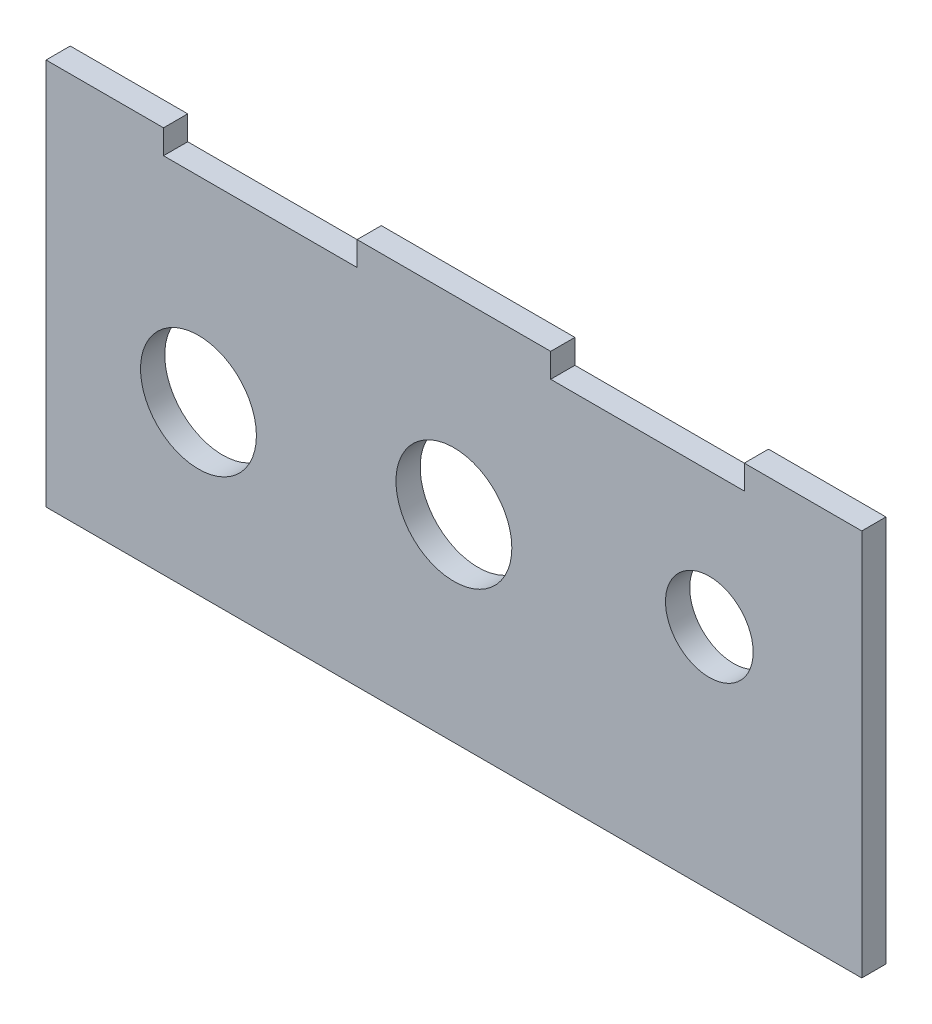
ISO-10303-21;
HEADER;
FILE_DESCRIPTION(('STEP AP214'),'2;1');
FILE_NAME('part.step','',(''),(''),'','','');
FILE_SCHEMA(('AUTOMOTIVE_DESIGN { 1 0 10303 214 1 1 1 1 }'));
ENDSEC;
DATA;
#1=APPLICATION_CONTEXT('core data for automotive mechanical design processes');
#2=APPLICATION_PROTOCOL_DEFINITION('international standard','automotive_design',2000,#1);
#3=PRODUCT_CONTEXT('',#1,'mechanical');
#4=PRODUCT('Part','Part','',(#3));
#5=PRODUCT_RELATED_PRODUCT_CATEGORY('part','',(#4));
#6=PRODUCT_DEFINITION_FORMATION('','',#4);
#7=PRODUCT_DEFINITION_CONTEXT('part definition',#1,'design');
#8=PRODUCT_DEFINITION('design','',#6,#7);
#9=PRODUCT_DEFINITION_SHAPE('','',#8);
#10=(LENGTH_UNIT() NAMED_UNIT(*) SI_UNIT(.MILLI.,.METRE.));
#11=(NAMED_UNIT(*) PLANE_ANGLE_UNIT() SI_UNIT($,.RADIAN.));
#12=(NAMED_UNIT(*) SI_UNIT($,.STERADIAN.) SOLID_ANGLE_UNIT());
#13=UNCERTAINTY_MEASURE_WITH_UNIT(LENGTH_MEASURE(1.E-05),#10,'distance_accuracy_value','');
#14=(GEOMETRIC_REPRESENTATION_CONTEXT(3) GLOBAL_UNCERTAINTY_ASSIGNED_CONTEXT((#13)) GLOBAL_UNIT_ASSIGNED_CONTEXT((#10,
#11,#12)) REPRESENTATION_CONTEXT('',''));
#15=CARTESIAN_POINT('',(0.,0.,0.));
#16=DIRECTION('',(0.,0.,1.));
#17=DIRECTION('',(1.,0.,0.));
#18=AXIS2_PLACEMENT_3D('',#15,#16,#17);
#19=CARTESIAN_POINT('',(0.,47.625,3.175));
#20=DIRECTION('',(0.,1.,0.));
#21=DIRECTION('',(0.,0.,1.));
#22=AXIS2_PLACEMENT_3D('',#19,#20,#21);
#23=PLANE('',#22);
#24=DIRECTION('',(1.,0.,0.));
#25=VECTOR('',#24,1.);
#26=CARTESIAN_POINT('',(0.,47.625,0.));
#27=LINE('',#26,#25);
#28=CARTESIAN_POINT('',(15.4128700790452,47.625,0.));
#29=VERTEX_POINT('',#28);
#30=CARTESIAN_POINT('',(40.8128700790452,47.625,0.));
#31=VERTEX_POINT('',#30);
#32=EDGE_CURVE('E167',#29,#31,#27,.T.);
#33=ORIENTED_EDGE('',*,*,#32,.F.);
#34=DIRECTION('',(0.,0.,-1.));
#35=VECTOR('',#34,1.);
#36=CARTESIAN_POINT('',(15.4128700790452,47.625,3.175));
#37=LINE('',#36,#35);
#38=CARTESIAN_POINT('',(15.4128700790452,47.625,3.175));
#39=VERTEX_POINT('',#38);
#40=EDGE_CURVE('E11',#39,#29,#37,.T.);
#41=ORIENTED_EDGE('',*,*,#40,.F.);
#42=DIRECTION('',(1.,0.,0.));
#43=VECTOR('',#42,1.);
#44=CARTESIAN_POINT('',(0.,47.625,3.175));
#45=LINE('',#44,#43);
#46=CARTESIAN_POINT('',(40.8128700790452,47.625,3.175));
#47=VERTEX_POINT('',#46);
#48=EDGE_CURVE('E203',#39,#47,#45,.T.);
#49=ORIENTED_EDGE('',*,*,#48,.T.);
#50=DIRECTION('',(0.,0.,-1.));
#51=VECTOR('',#50,1.);
#52=CARTESIAN_POINT('',(40.8128700790452,47.625,3.175));
#53=LINE('',#52,#51);
#54=EDGE_CURVE('E103',#47,#31,#53,.T.);
#55=ORIENTED_EDGE('',*,*,#54,.T.);
#56=EDGE_LOOP('',(#33,#41,#49,#55));
#57=FACE_BOUND('',#56,.T.);
#58=ADVANCED_FACE('F40',(#57),#23,.T.);
#59=CARTESIAN_POINT('',(15.4128700790452,0.,3.175));
#60=DIRECTION('',(1.,0.,0.));
#61=DIRECTION('',(0.,0.,-1.));
#62=AXIS2_PLACEMENT_3D('',#59,#60,#61);
#63=PLANE('',#62);
#64=DIRECTION('',(0.,-1.,0.));
#65=VECTOR('',#64,1.);
#66=CARTESIAN_POINT('',(15.4128700790452,0.,0.));
#67=LINE('',#66,#65);
#68=CARTESIAN_POINT('',(15.4128700790452,50.8,0.));
#69=VERTEX_POINT('',#68);
#70=EDGE_CURVE('E170',#69,#29,#67,.T.);
#71=ORIENTED_EDGE('',*,*,#70,.F.);
#72=DIRECTION('',(0.,0.,-1.));
#73=VECTOR('',#72,1.);
#74=CARTESIAN_POINT('',(15.4128700790452,50.8,3.175));
#75=LINE('',#74,#73);
#76=CARTESIAN_POINT('',(15.4128700790452,50.8,3.175));
#77=VERTEX_POINT('',#76);
#78=EDGE_CURVE('E49',#77,#69,#75,.T.);
#79=ORIENTED_EDGE('',*,*,#78,.F.);
#80=DIRECTION('',(0.,-1.,0.));
#81=VECTOR('',#80,1.);
#82=CARTESIAN_POINT('',(15.4128700790452,0.,3.175));
#83=LINE('',#82,#81);
#84=EDGE_CURVE('E241',#77,#39,#83,.T.);
#85=ORIENTED_EDGE('',*,*,#84,.T.);
#86=ORIENTED_EDGE('',*,*,#40,.T.);
#87=EDGE_LOOP('',(#71,#79,#85,#86));
#88=FACE_BOUND('',#87,.T.);
#89=ADVANCED_FACE('F42',(#88),#63,.T.);
#90=CARTESIAN_POINT('',(0.,50.8,3.175));
#91=DIRECTION('',(0.,1.,0.));
#92=DIRECTION('',(0.,0.,1.));
#93=AXIS2_PLACEMENT_3D('',#90,#91,#92);
#94=PLANE('',#93);
#95=DIRECTION('',(1.,0.,0.));
#96=VECTOR('',#95,1.);
#97=CARTESIAN_POINT('',(0.,50.8,0.));
#98=LINE('',#97,#96);
#99=CARTESIAN_POINT('',(0.,50.8,0.));
#100=VERTEX_POINT('',#99);
#101=EDGE_CURVE('E174',#100,#69,#98,.T.);
#102=ORIENTED_EDGE('',*,*,#101,.F.);
#103=DIRECTION('',(0.,0.,-1.));
#104=VECTOR('',#103,1.);
#105=CARTESIAN_POINT('',(0.,50.8,3.175));
#106=LINE('',#105,#104);
#107=CARTESIAN_POINT('',(0.,50.8,3.175));
#108=VERTEX_POINT('',#107);
#109=EDGE_CURVE('E218',#108,#100,#106,.T.);
#110=ORIENTED_EDGE('',*,*,#109,.F.);
#111=DIRECTION('',(1.,0.,0.));
#112=VECTOR('',#111,1.);
#113=CARTESIAN_POINT('',(0.,50.8,3.175));
#114=LINE('',#113,#112);
#115=EDGE_CURVE('E225',#108,#77,#114,.T.);
#116=ORIENTED_EDGE('',*,*,#115,.T.);
#117=ORIENTED_EDGE('',*,*,#78,.T.);
#118=EDGE_LOOP('',(#102,#110,#116,#117));
#119=FACE_BOUND('',#118,.T.);
#120=ADVANCED_FACE('F223',(#119),#94,.T.);
#121=CARTESIAN_POINT('',(0.,0.,3.175));
#122=DIRECTION('',(-1.,0.,0.));
#123=DIRECTION('',(0.,0.,1.));
#124=AXIS2_PLACEMENT_3D('',#121,#122,#123);
#125=PLANE('',#124);
#126=DIRECTION('',(0.,1.,0.));
#127=VECTOR('',#126,1.);
#128=CARTESIAN_POINT('',(0.,0.,0.));
#129=LINE('',#128,#127);
#130=CARTESIAN_POINT('',(0.,0.,0.));
#131=VERTEX_POINT('',#130);
#132=EDGE_CURVE('E177',#131,#100,#129,.T.);
#133=ORIENTED_EDGE('',*,*,#132,.F.);
#134=DIRECTION('',(0.,0.,-1.));
#135=VECTOR('',#134,1.);
#136=CARTESIAN_POINT('',(0.,0.,3.175));
#137=LINE('',#136,#135);
#138=CARTESIAN_POINT('',(0.,0.,3.175));
#139=VERTEX_POINT('',#138);
#140=EDGE_CURVE('E216',#139,#131,#137,.T.);
#141=ORIENTED_EDGE('',*,*,#140,.F.);
#142=DIRECTION('',(0.,1.,0.));
#143=VECTOR('',#142,1.);
#144=CARTESIAN_POINT('',(0.,0.,3.175));
#145=LINE('',#144,#143);
#146=EDGE_CURVE('E240',#139,#108,#145,.T.);
#147=ORIENTED_EDGE('',*,*,#146,.T.);
#148=ORIENTED_EDGE('',*,*,#109,.T.);
#149=EDGE_LOOP('',(#133,#141,#147,#148));
#150=FACE_BOUND('',#149,.T.);
#151=ADVANCED_FACE('F236',(#150),#125,.T.);
#152=CARTESIAN_POINT('',(0.,0.,3.175));
#153=DIRECTION('',(0.,1.,0.));
#154=DIRECTION('',(0.,0.,1.));
#155=AXIS2_PLACEMENT_3D('',#152,#153,#154);
#156=PLANE('',#155);
#157=DIRECTION('',(1.,0.,0.));
#158=VECTOR('',#157,1.);
#159=CARTESIAN_POINT('',(0.,0.,0.));
#160=LINE('',#159,#158);
#161=CARTESIAN_POINT('',(107.02574015809,0.,0.));
#162=VERTEX_POINT('',#161);
#163=EDGE_CURVE('E181',#131,#162,#160,.T.);
#164=ORIENTED_EDGE('',*,*,#163,.T.);
#165=DIRECTION('',(0.,0.,-1.));
#166=VECTOR('',#165,1.);
#167=CARTESIAN_POINT('',(107.02574015809,0.,3.175));
#168=LINE('',#167,#166);
#169=CARTESIAN_POINT('',(107.02574015809,0.,3.175));
#170=VERTEX_POINT('',#169);
#171=EDGE_CURVE('E213',#170,#162,#168,.T.);
#172=ORIENTED_EDGE('',*,*,#171,.F.);
#173=DIRECTION('',(1.,0.,0.));
#174=VECTOR('',#173,1.);
#175=CARTESIAN_POINT('',(0.,0.,3.175));
#176=LINE('',#175,#174);
#177=EDGE_CURVE('E244',#139,#170,#176,.T.);
#178=ORIENTED_EDGE('',*,*,#177,.F.);
#179=ORIENTED_EDGE('',*,*,#140,.T.);
#180=EDGE_LOOP('',(#164,#172,#178,#179));
#181=FACE_BOUND('',#180,.T.);
#182=ADVANCED_FACE('F258',(#181),#156,.F.);
#183=CARTESIAN_POINT('',(107.02574015809,0.,3.175));
#184=DIRECTION('',(-1.,0.,0.));
#185=DIRECTION('',(0.,0.,1.));
#186=AXIS2_PLACEMENT_3D('',#183,#184,#185);
#187=PLANE('',#186);
#188=DIRECTION('',(0.,1.,0.));
#189=VECTOR('',#188,1.);
#190=CARTESIAN_POINT('',(107.02574015809,0.,0.));
#191=LINE('',#190,#189);
#192=CARTESIAN_POINT('',(107.02574015809,50.8,0.));
#193=VERTEX_POINT('',#192);
#194=EDGE_CURVE('E183',#162,#193,#191,.T.);
#195=ORIENTED_EDGE('',*,*,#194,.T.);
#196=DIRECTION('',(0.,0.,-1.));
#197=VECTOR('',#196,1.);
#198=CARTESIAN_POINT('',(107.02574015809,50.8,3.175));
#199=LINE('',#198,#197);
#200=CARTESIAN_POINT('',(107.02574015809,50.8,3.175));
#201=VERTEX_POINT('',#200);
#202=EDGE_CURVE('E211',#201,#193,#199,.T.);
#203=ORIENTED_EDGE('',*,*,#202,.F.);
#204=DIRECTION('',(0.,1.,0.));
#205=VECTOR('',#204,1.);
#206=CARTESIAN_POINT('',(107.02574015809,0.,3.175));
#207=LINE('',#206,#205);
#208=EDGE_CURVE('E249',#170,#201,#207,.T.);
#209=ORIENTED_EDGE('',*,*,#208,.F.);
#210=ORIENTED_EDGE('',*,*,#171,.T.);
#211=EDGE_LOOP('',(#195,#203,#209,#210));
#212=FACE_BOUND('',#211,.T.);
#213=ADVANCED_FACE('F260',(#212),#187,.F.);
#214=CARTESIAN_POINT('',(91.6128700790452,50.8,0.));
#215=VERTEX_POINT('',#214);
#216=EDGE_CURVE('E178',#215,#193,#98,.T.);
#217=ORIENTED_EDGE('',*,*,#216,.F.);
#218=DIRECTION('',(0.,0.,-1.));
#219=VECTOR('',#218,1.);
#220=CARTESIAN_POINT('',(91.6128700790452,50.8,3.175));
#221=LINE('',#220,#219);
#222=CARTESIAN_POINT('',(91.6128700790452,50.8,3.175));
#223=VERTEX_POINT('',#222);
#224=EDGE_CURVE('E209',#223,#215,#221,.T.);
#225=ORIENTED_EDGE('',*,*,#224,.F.);
#226=EDGE_CURVE('E243',#223,#201,#114,.T.);
#227=ORIENTED_EDGE('',*,*,#226,.T.);
#228=ORIENTED_EDGE('',*,*,#202,.T.);
#229=EDGE_LOOP('',(#217,#225,#227,#228));
#230=FACE_BOUND('',#229,.T.);
#231=ADVANCED_FACE('F263',(#230),#94,.T.);
#232=CARTESIAN_POINT('',(91.6128700790452,0.,3.175));
#233=DIRECTION('',(1.,0.,0.));
#234=DIRECTION('',(0.,0.,-1.));
#235=AXIS2_PLACEMENT_3D('',#232,#233,#234);
#236=PLANE('',#235);
#237=DIRECTION('',(0.,-1.,0.));
#238=VECTOR('',#237,1.);
#239=CARTESIAN_POINT('',(91.6128700790452,0.,0.));
#240=LINE('',#239,#238);
#241=CARTESIAN_POINT('',(91.6128700790452,47.625,0.));
#242=VERTEX_POINT('',#241);
#243=EDGE_CURVE('E186',#215,#242,#240,.T.);
#244=ORIENTED_EDGE('',*,*,#243,.T.);
#245=DIRECTION('',(0.,0.,-1.));
#246=VECTOR('',#245,1.);
#247=CARTESIAN_POINT('',(91.6128700790452,47.625,3.175));
#248=LINE('',#247,#246);
#249=CARTESIAN_POINT('',(91.6128700790452,47.625,3.175));
#250=VERTEX_POINT('',#249);
#251=EDGE_CURVE('E207',#250,#242,#248,.T.);
#252=ORIENTED_EDGE('',*,*,#251,.F.);
#253=DIRECTION('',(0.,-1.,0.));
#254=VECTOR('',#253,1.);
#255=CARTESIAN_POINT('',(91.6128700790452,0.,3.175));
#256=LINE('',#255,#254);
#257=EDGE_CURVE('E248',#223,#250,#256,.T.);
#258=ORIENTED_EDGE('',*,*,#257,.F.);
#259=ORIENTED_EDGE('',*,*,#224,.T.);
#260=EDGE_LOOP('',(#244,#252,#258,#259));
#261=FACE_BOUND('',#260,.T.);
#262=ADVANCED_FACE('F270',(#261),#236,.F.);
#263=CARTESIAN_POINT('',(66.2128700790452,47.625,0.));
#264=VERTEX_POINT('',#263);
#265=EDGE_CURVE('E171',#264,#242,#27,.T.);
#266=ORIENTED_EDGE('',*,*,#265,.F.);
#267=DIRECTION('',(0.,0.,-1.));
#268=VECTOR('',#267,1.);
#269=CARTESIAN_POINT('',(66.2128700790452,47.625,3.175));
#270=LINE('',#269,#268);
#271=CARTESIAN_POINT('',(66.2128700790452,47.625,3.175));
#272=VERTEX_POINT('',#271);
#273=EDGE_CURVE('E144',#272,#264,#270,.T.);
#274=ORIENTED_EDGE('',*,*,#273,.F.);
#275=EDGE_CURVE('E151',#272,#250,#45,.T.);
#276=ORIENTED_EDGE('',*,*,#275,.T.);
#277=ORIENTED_EDGE('',*,*,#251,.T.);
#278=EDGE_LOOP('',(#266,#274,#276,#277));
#279=FACE_BOUND('',#278,.T.);
#280=ADVANCED_FACE('F272',(#279),#23,.T.);
#281=CARTESIAN_POINT('',(66.2128700790452,0.,3.175));
#282=DIRECTION('',(1.,0.,0.));
#283=DIRECTION('',(0.,0.,-1.));
#284=AXIS2_PLACEMENT_3D('',#281,#282,#283);
#285=PLANE('',#284);
#286=DIRECTION('',(0.,-1.,0.));
#287=VECTOR('',#286,1.);
#288=CARTESIAN_POINT('',(66.2128700790452,0.,0.));
#289=LINE('',#288,#287);
#290=CARTESIAN_POINT('',(66.2128700790452,50.8,0.));
#291=VERTEX_POINT('',#290);
#292=EDGE_CURVE('E139',#291,#264,#289,.T.);
#293=ORIENTED_EDGE('',*,*,#292,.F.);
#294=DIRECTION('',(0.,0.,-1.));
#295=VECTOR('',#294,1.);
#296=CARTESIAN_POINT('',(66.2128700790452,50.8,3.175));
#297=LINE('',#296,#295);
#298=CARTESIAN_POINT('',(66.2128700790452,50.8,3.175));
#299=VERTEX_POINT('',#298);
#300=EDGE_CURVE('E134',#299,#291,#297,.T.);
#301=ORIENTED_EDGE('',*,*,#300,.F.);
#302=DIRECTION('',(0.,-1.,0.));
#303=VECTOR('',#302,1.);
#304=CARTESIAN_POINT('',(66.2128700790452,0.,3.175));
#305=LINE('',#304,#303);
#306=EDGE_CURVE('E137',#299,#272,#305,.T.);
#307=ORIENTED_EDGE('',*,*,#306,.T.);
#308=ORIENTED_EDGE('',*,*,#273,.T.);
#309=EDGE_LOOP('',(#293,#301,#307,#308));
#310=FACE_BOUND('',#309,.T.);
#311=ADVANCED_FACE('F136',(#310),#285,.T.);
#312=CARTESIAN_POINT('',(0.,50.8,3.175));
#313=DIRECTION('',(0.,1.,0.));
#314=DIRECTION('',(0.,0.,1.));
#315=AXIS2_PLACEMENT_3D('',#312,#313,#314);
#316=PLANE('',#315);
#317=DIRECTION('',(1.,0.,0.));
#318=VECTOR('',#317,1.);
#319=CARTESIAN_POINT('',(0.,50.8,0.));
#320=LINE('',#319,#318);
#321=CARTESIAN_POINT('',(40.8128700790452,50.8,0.));
#322=VERTEX_POINT('',#321);
#323=EDGE_CURVE('E190',#322,#291,#320,.T.);
#324=ORIENTED_EDGE('',*,*,#323,.F.);
#325=DIRECTION('',(0.,0.,-1.));
#326=VECTOR('',#325,1.);
#327=CARTESIAN_POINT('',(40.8128700790452,50.8,3.175));
#328=LINE('',#327,#326);
#329=CARTESIAN_POINT('',(40.8128700790452,50.8,3.175));
#330=VERTEX_POINT('',#329);
#331=EDGE_CURVE('E96',#330,#322,#328,.T.);
#332=ORIENTED_EDGE('',*,*,#331,.F.);
#333=DIRECTION('',(1.,0.,0.));
#334=VECTOR('',#333,1.);
#335=CARTESIAN_POINT('',(0.,50.8,3.175));
#336=LINE('',#335,#334);
#337=EDGE_CURVE('E149',#330,#299,#336,.T.);
#338=ORIENTED_EDGE('',*,*,#337,.T.);
#339=ORIENTED_EDGE('',*,*,#300,.T.);
#340=EDGE_LOOP('',(#324,#332,#338,#339));
#341=FACE_BOUND('',#340,.T.);
#342=ADVANCED_FACE('F153',(#341),#316,.T.);
#343=CARTESIAN_POINT('',(53.5128641205135,25.9063,3.175));
#344=DIRECTION('',(0.,0.,-1.));
#345=DIRECTION('',(-1.,0.,0.));
#346=AXIS2_PLACEMENT_3D('',#343,#344,#345);
#347=CYLINDRICAL_SURFACE('',#346,7.6);
#348=CARTESIAN_POINT('',(53.5128641205135,25.9063,3.175));
#349=DIRECTION('',(0.,0.,1.));
#350=DIRECTION('',(1.,0.,0.));
#351=AXIS2_PLACEMENT_3D('',#348,#349,#350);
#352=CIRCLE('',#351,7.6);
#353=CARTESIAN_POINT('',(61.1128641205135,25.9063,3.175));
#354=VERTEX_POINT('',#353);
#355=EDGE_CURVE('E161',#354,#354,#352,.T.);
#356=ORIENTED_EDGE('',*,*,#355,.T.);
#357=EDGE_LOOP('',(#356));
#358=FACE_BOUND('',#357,.T.);
#359=CARTESIAN_POINT('',(53.5128641205135,25.9063,0.));
#360=DIRECTION('',(0.,0.,1.));
#361=DIRECTION('',(1.,0.,0.));
#362=AXIS2_PLACEMENT_3D('',#359,#360,#361);
#363=CIRCLE('',#362,7.6);
#364=CARTESIAN_POINT('',(61.1128641205135,25.9063,0.));
#365=VERTEX_POINT('',#364);
#366=EDGE_CURVE('E197',#365,#365,#363,.T.);
#367=ORIENTED_EDGE('',*,*,#366,.F.);
#368=EDGE_LOOP('',(#367));
#369=FACE_BOUND('',#368,.T.);
#370=ADVANCED_FACE('F359',(#358,#369),#347,.F.);
#371=CARTESIAN_POINT('',(87.0257401580904,29.9,3.175));
#372=DIRECTION('',(0.,0.,-1.));
#373=DIRECTION('',(-1.,0.,0.));
#374=AXIS2_PLACEMENT_3D('',#371,#372,#373);
#375=CYLINDRICAL_SURFACE('',#374,5.75);
#376=CARTESIAN_POINT('',(87.0257401580904,29.9,3.175));
#377=DIRECTION('',(0.,0.,1.));
#378=DIRECTION('',(1.,0.,0.));
#379=AXIS2_PLACEMENT_3D('',#376,#377,#378);
#380=CIRCLE('',#379,5.75);
#381=CARTESIAN_POINT('',(92.7757401580905,29.9,3.175));
#382=VERTEX_POINT('',#381);
#383=EDGE_CURVE('E155',#382,#382,#380,.T.);
#384=ORIENTED_EDGE('',*,*,#383,.T.);
#385=EDGE_LOOP('',(#384));
#386=FACE_BOUND('',#385,.T.);
#387=CARTESIAN_POINT('',(87.0257401580904,29.9,0.));
#388=DIRECTION('',(0.,0.,1.));
#389=DIRECTION('',(1.,0.,0.));
#390=AXIS2_PLACEMENT_3D('',#387,#388,#389);
#391=CIRCLE('',#390,5.75);
#392=CARTESIAN_POINT('',(92.7757401580905,29.9,0.));
#393=VERTEX_POINT('',#392);
#394=EDGE_CURVE('E194',#393,#393,#391,.T.);
#395=ORIENTED_EDGE('',*,*,#394,.F.);
#396=EDGE_LOOP('',(#395));
#397=FACE_BOUND('',#396,.T.);
#398=ADVANCED_FACE('F367',(#386,#397),#375,.F.);
#399=CARTESIAN_POINT('',(40.8128700790452,0.,3.175));
#400=DIRECTION('',(1.,0.,0.));
#401=DIRECTION('',(0.,0.,-1.));
#402=AXIS2_PLACEMENT_3D('',#399,#400,#401);
#403=PLANE('',#402);
#404=DIRECTION('',(0.,-1.,0.));
#405=VECTOR('',#404,1.);
#406=CARTESIAN_POINT('',(40.8128700790452,0.,0.));
#407=LINE('',#406,#405);
#408=EDGE_CURVE('E192',#322,#31,#407,.T.);
#409=ORIENTED_EDGE('',*,*,#408,.T.);
#410=ORIENTED_EDGE('',*,*,#54,.F.);
#411=DIRECTION('',(0.,-1.,0.));
#412=VECTOR('',#411,1.);
#413=CARTESIAN_POINT('',(40.8128700790452,0.,3.175));
#414=LINE('',#413,#412);
#415=EDGE_CURVE('E57',#330,#47,#414,.T.);
#416=ORIENTED_EDGE('',*,*,#415,.F.);
#417=ORIENTED_EDGE('',*,*,#331,.T.);
#418=EDGE_LOOP('',(#409,#410,#416,#417));
#419=FACE_BOUND('',#418,.T.);
#420=ADVANCED_FACE('F376',(#419),#403,.F.);
#421=CARTESIAN_POINT('',(20.,21.9125,3.175));
#422=DIRECTION('',(0.,0.,-1.));
#423=DIRECTION('',(-1.,0.,0.));
#424=AXIS2_PLACEMENT_3D('',#421,#422,#423);
#425=CYLINDRICAL_SURFACE('',#424,7.6);
#426=CARTESIAN_POINT('',(20.,21.9125,3.175));
#427=DIRECTION('',(0.,0.,1.));
#428=DIRECTION('',(1.,0.,0.));
#429=AXIS2_PLACEMENT_3D('',#426,#427,#428);
#430=CIRCLE('',#429,7.6);
#431=CARTESIAN_POINT('',(27.6,21.9125,3.175));
#432=VERTEX_POINT('',#431);
#433=EDGE_CURVE('E164',#432,#432,#430,.T.);
#434=ORIENTED_EDGE('',*,*,#433,.T.);
#435=EDGE_LOOP('',(#434));
#436=FACE_BOUND('',#435,.T.);
#437=CARTESIAN_POINT('',(20.,21.9125,0.));
#438=DIRECTION('',(0.,0.,1.));
#439=DIRECTION('',(1.,0.,0.));
#440=AXIS2_PLACEMENT_3D('',#437,#438,#439);
#441=CIRCLE('',#440,7.6);
#442=CARTESIAN_POINT('',(27.6,21.9125,0.));
#443=VERTEX_POINT('',#442);
#444=EDGE_CURVE('E200',#443,#443,#441,.T.);
#445=ORIENTED_EDGE('',*,*,#444,.F.);
#446=EDGE_LOOP('',(#445));
#447=FACE_BOUND('',#446,.T.);
#448=ADVANCED_FACE('F385',(#436,#447),#425,.F.);
#449=CARTESIAN_POINT('',(0.,0.,3.175));
#450=DIRECTION('',(0.,0.,1.));
#451=DIRECTION('',(1.,0.,0.));
#452=AXIS2_PLACEMENT_3D('',#449,#450,#451);
#453=PLANE('',#452);
#454=ORIENTED_EDGE('',*,*,#48,.F.);
#455=ORIENTED_EDGE('',*,*,#84,.F.);
#456=ORIENTED_EDGE('',*,*,#115,.F.);
#457=ORIENTED_EDGE('',*,*,#146,.F.);
#458=ORIENTED_EDGE('',*,*,#177,.T.);
#459=ORIENTED_EDGE('',*,*,#208,.T.);
#460=ORIENTED_EDGE('',*,*,#226,.F.);
#461=ORIENTED_EDGE('',*,*,#257,.T.);
#462=ORIENTED_EDGE('',*,*,#275,.F.);
#463=ORIENTED_EDGE('',*,*,#306,.F.);
#464=ORIENTED_EDGE('',*,*,#337,.F.);
#465=ORIENTED_EDGE('',*,*,#415,.T.);
#466=EDGE_LOOP('',(#454,#455,#456,#457,#458,#459,#460,#461,#462,#463,#464,#465));
#467=FACE_BOUND('',#466,.T.);
#468=ORIENTED_EDGE('',*,*,#383,.F.);
#469=EDGE_LOOP('',(#468));
#470=FACE_BOUND('',#469,.T.);
#471=ORIENTED_EDGE('',*,*,#355,.F.);
#472=EDGE_LOOP('',(#471));
#473=FACE_BOUND('',#472,.T.);
#474=ORIENTED_EDGE('',*,*,#433,.F.);
#475=EDGE_LOOP('',(#474));
#476=FACE_BOUND('',#475,.T.);
#477=ADVANCED_FACE('F147',(#467,#470,#473,#476),#453,.T.);
#478=CARTESIAN_POINT('',(0.,0.,0.));
#479=DIRECTION('',(0.,0.,1.));
#480=DIRECTION('',(1.,0.,0.));
#481=AXIS2_PLACEMENT_3D('',#478,#479,#480);
#482=PLANE('',#481);
#483=ORIENTED_EDGE('',*,*,#32,.T.);
#484=ORIENTED_EDGE('',*,*,#408,.F.);
#485=ORIENTED_EDGE('',*,*,#323,.T.);
#486=ORIENTED_EDGE('',*,*,#292,.T.);
#487=ORIENTED_EDGE('',*,*,#265,.T.);
#488=ORIENTED_EDGE('',*,*,#243,.F.);
#489=ORIENTED_EDGE('',*,*,#216,.T.);
#490=ORIENTED_EDGE('',*,*,#194,.F.);
#491=ORIENTED_EDGE('',*,*,#163,.F.);
#492=ORIENTED_EDGE('',*,*,#132,.T.);
#493=ORIENTED_EDGE('',*,*,#101,.T.);
#494=ORIENTED_EDGE('',*,*,#70,.T.);
#495=EDGE_LOOP('',(#483,#484,#485,#486,#487,#488,#489,#490,#491,#492,#493,#494));
#496=FACE_BOUND('',#495,.T.);
#497=ORIENTED_EDGE('',*,*,#394,.T.);
#498=EDGE_LOOP('',(#497));
#499=FACE_BOUND('',#498,.T.);
#500=ORIENTED_EDGE('',*,*,#366,.T.);
#501=EDGE_LOOP('',(#500));
#502=FACE_BOUND('',#501,.T.);
#503=ORIENTED_EDGE('',*,*,#444,.T.);
#504=EDGE_LOOP('',(#503));
#505=FACE_BOUND('',#504,.T.);
#506=ADVANCED_FACE('F230',(#496,#499,#502,#505),#482,.F.);
#507=CLOSED_SHELL('',(#58,#89,#120,#151,#182,#213,#231,#262,#280,#311,#342,#370,#398,#420,#448,
#477,#506));
#508=MANIFOLD_SOLID_BREP('B2',#507);
#509=ADVANCED_BREP_SHAPE_REPRESENTATION('',(#18,#508),#14);
#510=SHAPE_DEFINITION_REPRESENTATION(#9,#509);
ENDSEC;
END-ISO-10303-21;
